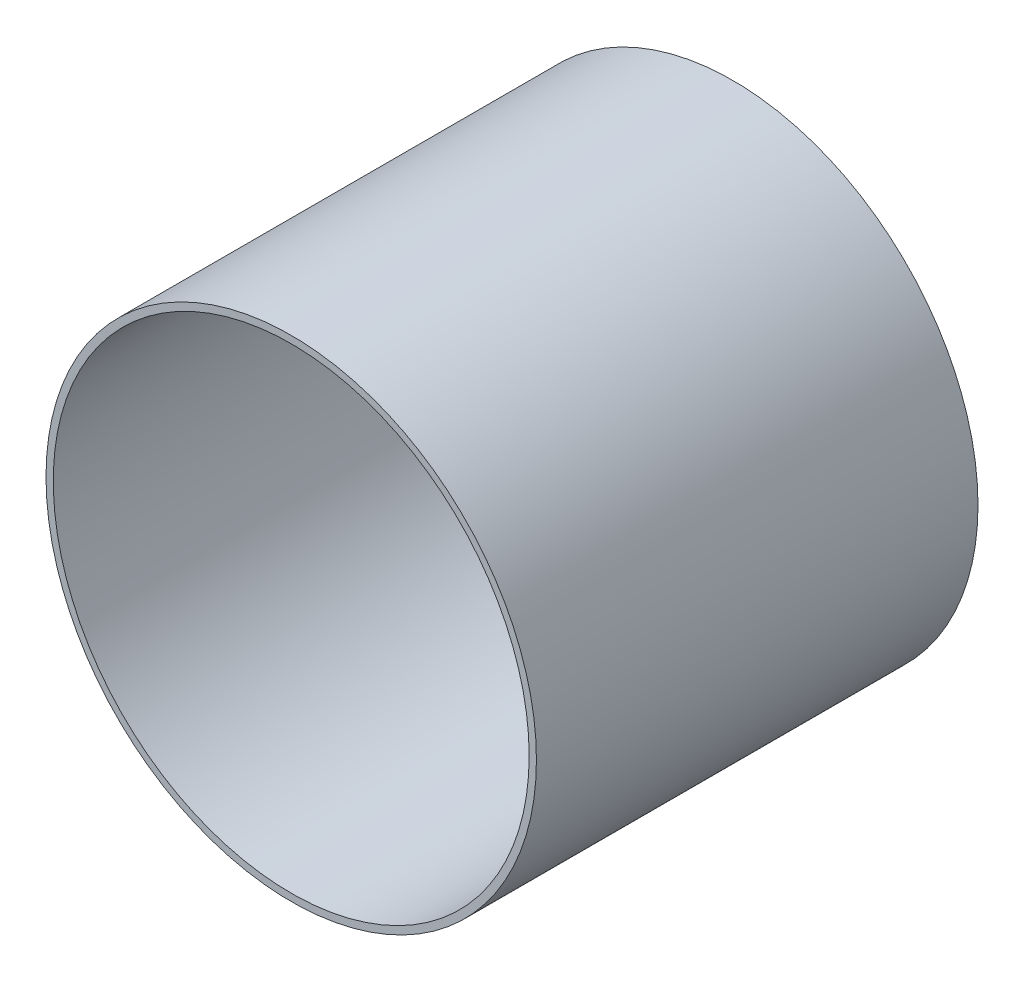
ISO-10303-21;
HEADER;
FILE_DESCRIPTION(('STEP AP214'),'2;1');
FILE_NAME('part.step','',(''),(''),'','','');
FILE_SCHEMA(('AUTOMOTIVE_DESIGN { 1 0 10303 214 1 1 1 1 }'));
ENDSEC;
DATA;
#1=APPLICATION_CONTEXT('core data for automotive mechanical design processes');
#2=APPLICATION_PROTOCOL_DEFINITION('international standard','automotive_design',2000,#1);
#3=PRODUCT_CONTEXT('',#1,'mechanical');
#4=PRODUCT('Part','Part','',(#3));
#5=PRODUCT_RELATED_PRODUCT_CATEGORY('part','',(#4));
#6=PRODUCT_DEFINITION_FORMATION('','',#4);
#7=PRODUCT_DEFINITION_CONTEXT('part definition',#1,'design');
#8=PRODUCT_DEFINITION('design','',#6,#7);
#9=PRODUCT_DEFINITION_SHAPE('','',#8);
#10=(LENGTH_UNIT() NAMED_UNIT(*) SI_UNIT(.MILLI.,.METRE.));
#11=(NAMED_UNIT(*) PLANE_ANGLE_UNIT() SI_UNIT($,.RADIAN.));
#12=(NAMED_UNIT(*) SI_UNIT($,.STERADIAN.) SOLID_ANGLE_UNIT());
#13=UNCERTAINTY_MEASURE_WITH_UNIT(LENGTH_MEASURE(1.E-05),#10,'distance_accuracy_value','');
#14=(GEOMETRIC_REPRESENTATION_CONTEXT(3) GLOBAL_UNCERTAINTY_ASSIGNED_CONTEXT((#13)) GLOBAL_UNIT_ASSIGNED_CONTEXT((#10,
#11,#12)) REPRESENTATION_CONTEXT('',''));
#15=CARTESIAN_POINT('',(0.,0.,0.));
#16=DIRECTION('',(0.,0.,1.));
#17=DIRECTION('',(1.,0.,0.));
#18=AXIS2_PLACEMENT_3D('',#15,#16,#17);
#19=CARTESIAN_POINT('',(0.,0.,57.15));
#20=DIRECTION('',(0.,0.,1.));
#21=DIRECTION('',(1.,0.,0.));
#22=AXIS2_PLACEMENT_3D('',#19,#20,#21);
#23=PLANE('',#22);
#24=CARTESIAN_POINT('',(0.,0.,57.15));
#25=DIRECTION('',(0.,0.,1.));
#26=DIRECTION('',(1.,0.,0.));
#27=AXIS2_PLACEMENT_3D('',#24,#25,#26);
#28=CIRCLE('',#27,63.4746);
#29=CARTESIAN_POINT('',(63.4746,0.,57.15));
#30=VERTEX_POINT('',#29);
#31=EDGE_CURVE('E10',#30,#30,#28,.T.);
#32=ORIENTED_EDGE('',*,*,#31,.T.);
#33=EDGE_LOOP('',(#32));
#34=FACE_BOUND('',#33,.T.);
#35=CARTESIAN_POINT('',(0.,0.,57.15));
#36=DIRECTION('',(0.,0.,1.));
#37=DIRECTION('',(1.,0.,0.));
#38=AXIS2_PLACEMENT_3D('',#35,#36,#37);
#39=CIRCLE('',#38,61.595);
#40=CARTESIAN_POINT('',(61.595,0.,57.15));
#41=VERTEX_POINT('',#40);
#42=EDGE_CURVE('E54',#41,#41,#39,.T.);
#43=ORIENTED_EDGE('',*,*,#42,.F.);
#44=EDGE_LOOP('',(#43));
#45=FACE_BOUND('',#44,.T.);
#46=ADVANCED_FACE('F43',(#34,#45),#23,.T.);
#47=CARTESIAN_POINT('',(0.,0.,-57.15));
#48=DIRECTION('',(0.,0.,1.));
#49=DIRECTION('',(1.,0.,0.));
#50=AXIS2_PLACEMENT_3D('',#47,#48,#49);
#51=PLANE('',#50);
#52=CARTESIAN_POINT('',(0.,0.,-57.15));
#53=DIRECTION('',(0.,0.,1.));
#54=DIRECTION('',(1.,0.,0.));
#55=AXIS2_PLACEMENT_3D('',#52,#53,#54);
#56=CIRCLE('',#55,63.4746);
#57=CARTESIAN_POINT('',(63.4746,0.,-57.15));
#58=VERTEX_POINT('',#57);
#59=EDGE_CURVE('E47',#58,#58,#56,.T.);
#60=ORIENTED_EDGE('',*,*,#59,.F.);
#61=EDGE_LOOP('',(#60));
#62=FACE_BOUND('',#61,.T.);
#63=CARTESIAN_POINT('',(0.,0.,-57.15));
#64=DIRECTION('',(0.,0.,1.));
#65=DIRECTION('',(1.,0.,0.));
#66=AXIS2_PLACEMENT_3D('',#63,#64,#65);
#67=CIRCLE('',#66,61.595);
#68=CARTESIAN_POINT('',(61.595,0.,-57.15));
#69=VERTEX_POINT('',#68);
#70=EDGE_CURVE('E56',#69,#69,#67,.T.);
#71=ORIENTED_EDGE('',*,*,#70,.T.);
#72=EDGE_LOOP('',(#71));
#73=FACE_BOUND('',#72,.T.);
#74=ADVANCED_FACE('F66',(#62,#73),#51,.F.);
#75=CARTESIAN_POINT('',(0.,0.,57.15));
#76=DIRECTION('',(0.,0.,-1.));
#77=DIRECTION('',(-1.,0.,0.));
#78=AXIS2_PLACEMENT_3D('',#75,#76,#77);
#79=CYLINDRICAL_SURFACE('',#78,63.4746);
#80=ORIENTED_EDGE('',*,*,#31,.F.);
#81=EDGE_LOOP('',(#80));
#82=FACE_BOUND('',#81,.T.);
#83=ORIENTED_EDGE('',*,*,#59,.T.);
#84=EDGE_LOOP('',(#83));
#85=FACE_BOUND('',#84,.T.);
#86=ADVANCED_FACE('F45',(#82,#85),#79,.T.);
#87=CARTESIAN_POINT('',(0.,0.,57.15));
#88=DIRECTION('',(0.,0.,-1.));
#89=DIRECTION('',(-1.,0.,0.));
#90=AXIS2_PLACEMENT_3D('',#87,#88,#89);
#91=CYLINDRICAL_SURFACE('',#90,61.595);
#92=ORIENTED_EDGE('',*,*,#42,.T.);
#93=EDGE_LOOP('',(#92));
#94=FACE_BOUND('',#93,.T.);
#95=ORIENTED_EDGE('',*,*,#70,.F.);
#96=EDGE_LOOP('',(#95));
#97=FACE_BOUND('',#96,.T.);
#98=ADVANCED_FACE('F62',(#94,#97),#91,.F.);
#99=CLOSED_SHELL('',(#46,#74,#86,#98));
#100=MANIFOLD_SOLID_BREP('B2',#99);
#101=ADVANCED_BREP_SHAPE_REPRESENTATION('',(#18,#100),#14);
#102=SHAPE_DEFINITION_REPRESENTATION(#9,#101);
ENDSEC;
END-ISO-10303-21;
